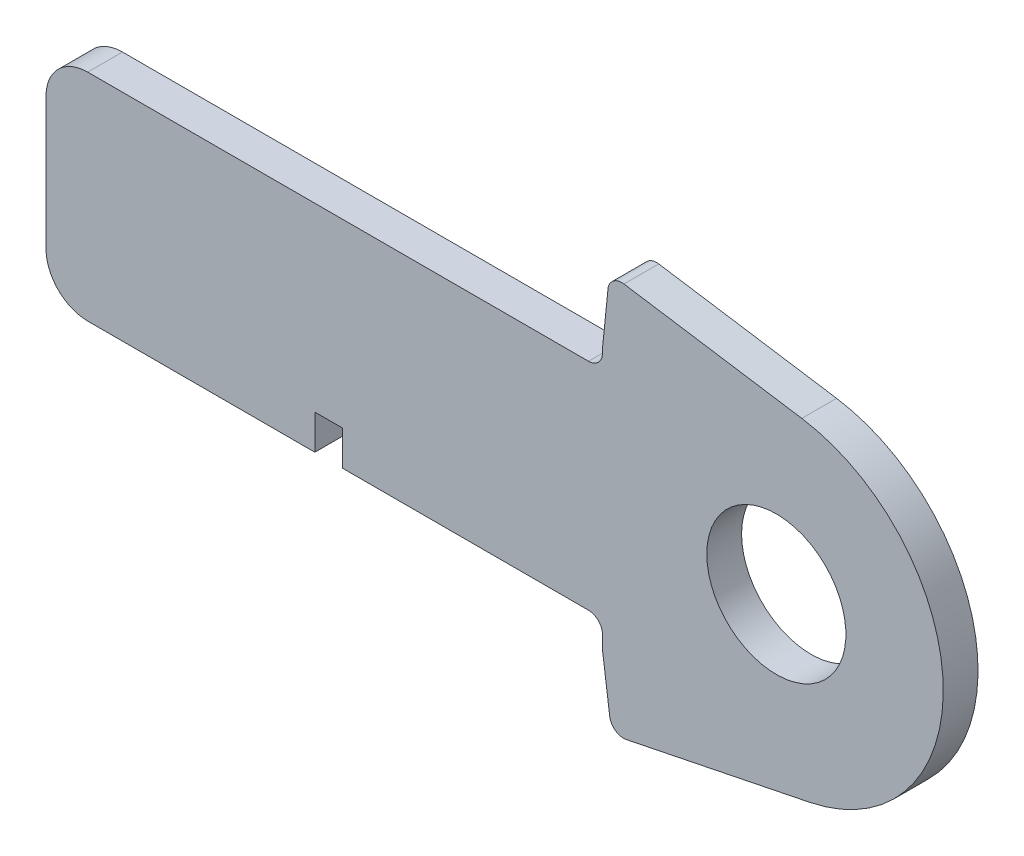
ISO-10303-21;
HEADER;
FILE_DESCRIPTION(('STEP AP214'),'2;1');
FILE_NAME('part.step','',(''),(''),'','','');
FILE_SCHEMA(('AUTOMOTIVE_DESIGN { 1 0 10303 214 1 1 1 1 }'));
ENDSEC;
DATA;
#1=APPLICATION_CONTEXT('core data for automotive mechanical design processes');
#2=APPLICATION_PROTOCOL_DEFINITION('international standard','automotive_design',2000,#1);
#3=PRODUCT_CONTEXT('',#1,'mechanical');
#4=PRODUCT('Part','Part','',(#3));
#5=PRODUCT_RELATED_PRODUCT_CATEGORY('part','',(#4));
#6=PRODUCT_DEFINITION_FORMATION('','',#4);
#7=PRODUCT_DEFINITION_CONTEXT('part definition',#1,'design');
#8=PRODUCT_DEFINITION('design','',#6,#7);
#9=PRODUCT_DEFINITION_SHAPE('','',#8);
#10=(LENGTH_UNIT() NAMED_UNIT(*) SI_UNIT(.MILLI.,.METRE.));
#11=(NAMED_UNIT(*) PLANE_ANGLE_UNIT() SI_UNIT($,.RADIAN.));
#12=(NAMED_UNIT(*) SI_UNIT($,.STERADIAN.) SOLID_ANGLE_UNIT());
#13=UNCERTAINTY_MEASURE_WITH_UNIT(LENGTH_MEASURE(1.E-05),#10,'distance_accuracy_value','');
#14=(GEOMETRIC_REPRESENTATION_CONTEXT(3) GLOBAL_UNCERTAINTY_ASSIGNED_CONTEXT((#13)) GLOBAL_UNIT_ASSIGNED_CONTEXT((#10,
#11,#12)) REPRESENTATION_CONTEXT('',''));
#15=CARTESIAN_POINT('',(0.,0.,0.));
#16=DIRECTION('',(0.,0.,1.));
#17=DIRECTION('',(1.,0.,0.));
#18=AXIS2_PLACEMENT_3D('',#15,#16,#17);
#19=CARTESIAN_POINT('',(213.422580288689,54.7287513036553,3.175));
#20=DIRECTION('',(0.,0.,-1.));
#21=DIRECTION('',(-1.,0.,0.));
#22=AXIS2_PLACEMENT_3D('',#19,#20,#21);
#23=PLANE('',#22);
#24=CARTESIAN_POINT('',(292.383806587551,26.255421434861,3.175));
#25=DIRECTION('',(0.,0.,-1.));
#26=DIRECTION('',(-1.,0.,0.));
#27=AXIS2_PLACEMENT_3D('',#24,#25,#26);
#28=CIRCLE('',#27,6.35);
#29=CARTESIAN_POINT('',(286.033806587551,26.255421434861,3.175));
#30=VERTEX_POINT('',#29);
#31=EDGE_CURVE('E292',#30,#30,#28,.T.);
#32=ORIENTED_EDGE('',*,*,#31,.T.);
#33=EDGE_LOOP('',(#32));
#34=FACE_BOUND('',#33,.T.);
#35=DIRECTION('',(-0.133331034869946,0.991071559041278,0.));
#36=VECTOR('',#35,1.);
#37=CARTESIAN_POINT('',(273.434595269181,36.7857570161253,3.175));
#38=LINE('',#37,#36);
#39=CARTESIAN_POINT('',(277.174368657139,8.98740499943636,3.175));
#40=VERTEX_POINT('',#39);
#41=CARTESIAN_POINT('',(276.508806587551,13.9346375667709,3.175));
#42=VERTEX_POINT('',#41);
#43=EDGE_CURVE('E243',#40,#42,#38,.T.);
#44=ORIENTED_EDGE('',*,*,#43,.F.);
#45=CARTESIAN_POINT('',(278.433029537121,9.15673541372118,3.175));
#46=DIRECTION('',(0.,0.,-1.));
#47=DIRECTION('',(-1.,0.,0.));
#48=AXIS2_PLACEMENT_3D('',#45,#46,#47);
#49=CIRCLE('',#48,1.27);
#50=CARTESIAN_POINT('',(278.686524593638,7.91229165994138,3.175));
#51=VERTEX_POINT('',#50);
#52=EDGE_CURVE('E318',#40,#51,#49,.F.);
#53=ORIENTED_EDGE('',*,*,#52,.T.);
#54=DIRECTION('',(0.979876971480177,0.199602406706023,0.));
#55=VECTOR('',#54,1.);
#56=CARTESIAN_POINT('',(9.55565157305778,-46.9100702664279,3.175));
#57=LINE('',#56,#55);
#58=CARTESIAN_POINT('',(295.425747265751,11.3220963895031,3.175));
#59=VERTEX_POINT('',#58);
#60=EDGE_CURVE('E241',#51,#59,#57,.T.);
#61=ORIENTED_EDGE('',*,*,#60,.T.);
#62=CARTESIAN_POINT('',(292.383806587551,26.255421434861,3.175));
#63=DIRECTION('',(0.,0.,1.));
#64=DIRECTION('',(1.,0.,0.));
#65=AXIS2_PLACEMENT_3D('',#62,#63,#64);
#66=CIRCLE('',#65,15.24);
#67=CARTESIAN_POINT('',(294.709258182036,41.3169577071576,3.175));
#68=VERTEX_POINT('',#67);
#69=EDGE_CURVE('E269',#59,#68,#66,.T.);
#70=ORIENTED_EDGE('',*,*,#69,.T.);
#71=DIRECTION('',(0.988289781646758,-0.152588687302186,0.));
#72=VECTOR('',#71,1.);
#73=CARTESIAN_POINT('',(13.0924795434369,84.7976608093711,3.175));
#74=LINE('',#73,#72);
#75=CARTESIAN_POINT('',(278.470624311763,43.824149293938,3.175));
#76=VERTEX_POINT('',#75);
#77=EDGE_CURVE('E267',#76,#68,#74,.T.);
#78=ORIENTED_EDGE('',*,*,#77,.F.);
#79=CARTESIAN_POINT('',(278.27683667889,42.5690212712466,3.175));
#80=DIRECTION('',(0.,0.,-1.));
#81=DIRECTION('',(-1.,0.,0.));
#82=AXIS2_PLACEMENT_3D('',#79,#80,#81);
#83=CIRCLE('',#82,1.27);
#84=CARTESIAN_POINT('',(277.013295568393,42.6969425833287,3.175));
#85=VERTEX_POINT('',#84);
#86=EDGE_CURVE('E316',#76,#85,#83,.F.);
#87=ORIENTED_EDGE('',*,*,#86,.T.);
#88=DIRECTION('',(0.10072544258434,0.994914260233609,0.));
#89=VECTOR('',#88,1.);
#90=CARTESIAN_POINT('',(269.924029023359,-27.3271962964349,3.175));
#91=LINE('',#90,#89);
#92=CARTESIAN_POINT('',(276.508806587551,37.7138591806421,3.175));
#93=VERTEX_POINT('',#92);
#94=EDGE_CURVE('E264',#93,#85,#91,.T.);
#95=ORIENTED_EDGE('',*,*,#94,.F.);
#96=DIRECTION('',(0.,1.,0.));
#97=VECTOR('',#96,1.);
#98=CARTESIAN_POINT('',(276.508806587551,0.,3.175));
#99=LINE('',#98,#97);
#100=CARTESIAN_POINT('',(276.508806587551,37.367921434861,3.175));
#101=VERTEX_POINT('',#100);
#102=EDGE_CURVE('E247',#101,#93,#99,.T.);
#103=ORIENTED_EDGE('',*,*,#102,.F.);
#104=CARTESIAN_POINT('',(275.238806587551,37.367921434861,3.175));
#105=DIRECTION('',(0.,0.,-1.));
#106=DIRECTION('',(-1.,0.,0.));
#107=AXIS2_PLACEMENT_3D('',#104,#105,#106);
#108=CIRCLE('',#107,1.27);
#109=CARTESIAN_POINT('',(275.238806587551,36.097921434861,3.175));
#110=VERTEX_POINT('',#109);
#111=EDGE_CURVE('E57',#101,#110,#108,.T.);
#112=ORIENTED_EDGE('',*,*,#111,.T.);
#113=DIRECTION('',(1.,0.,0.));
#114=VECTOR('',#113,1.);
#115=CARTESIAN_POINT('',(0.,36.097921434861,3.175));
#116=LINE('',#115,#114);
#117=CARTESIAN_POINT('',(229.518806587551,36.097921434861,3.175));
#118=VERTEX_POINT('',#117);
#119=EDGE_CURVE('E261',#118,#110,#116,.T.);
#120=ORIENTED_EDGE('',*,*,#119,.F.);
#121=CARTESIAN_POINT('',(229.518806587551,32.287921434861,3.175));
#122=DIRECTION('',(0.,0.,-1.));
#123=DIRECTION('',(-1.,0.,0.));
#124=AXIS2_PLACEMENT_3D('',#121,#122,#123);
#125=CIRCLE('',#124,3.81);
#126=CARTESIAN_POINT('',(225.708806587551,32.287921434861,3.175));
#127=VERTEX_POINT('',#126);
#128=EDGE_CURVE('E300',#118,#127,#125,.F.);
#129=ORIENTED_EDGE('',*,*,#128,.T.);
#130=DIRECTION('',(0.,-1.,0.));
#131=VECTOR('',#130,1.);
#132=CARTESIAN_POINT('',(225.708806587551,0.,3.175));
#133=LINE('',#132,#131);
#134=CARTESIAN_POINT('',(225.708806587551,20.222921434861,3.175));
#135=VERTEX_POINT('',#134);
#136=EDGE_CURVE('E258',#127,#135,#133,.T.);
#137=ORIENTED_EDGE('',*,*,#136,.T.);
#138=CARTESIAN_POINT('',(229.518806587551,20.222921434861,3.175));
#139=DIRECTION('',(0.,0.,-1.));
#140=DIRECTION('',(-1.,0.,0.));
#141=AXIS2_PLACEMENT_3D('',#138,#139,#140);
#142=CIRCLE('',#141,3.81);
#143=CARTESIAN_POINT('',(229.518806587551,16.412921434861,3.175));
#144=VERTEX_POINT('',#143);
#145=EDGE_CURVE('E302',#135,#144,#142,.F.);
#146=ORIENTED_EDGE('',*,*,#145,.T.);
#147=DIRECTION('',(1.,0.,0.));
#148=VECTOR('',#147,1.);
#149=CARTESIAN_POINT('',(0.,16.412921434861,3.175));
#150=LINE('',#149,#148);
#151=CARTESIAN_POINT('',(250.254440989192,16.412921434861,3.175));
#152=VERTEX_POINT('',#151);
#153=EDGE_CURVE('E250',#144,#152,#150,.T.);
#154=ORIENTED_EDGE('',*,*,#153,.T.);
#155=DIRECTION('',(0.,1.,0.));
#156=VECTOR('',#155,1.);
#157=CARTESIAN_POINT('',(250.254440989192,0.,3.175));
#158=LINE('',#157,#156);
#159=CARTESIAN_POINT('',(250.254440989192,19.587921434861,3.175));
#160=VERTEX_POINT('',#159);
#161=EDGE_CURVE('E255',#152,#160,#158,.T.);
#162=ORIENTED_EDGE('',*,*,#161,.T.);
#163=DIRECTION('',(1.,0.,0.));
#164=VECTOR('',#163,1.);
#165=CARTESIAN_POINT('',(0.,19.587921434861,3.175));
#166=LINE('',#165,#164);
#167=CARTESIAN_POINT('',(252.794440989192,19.587921434861,3.175));
#168=VERTEX_POINT('',#167);
#169=EDGE_CURVE('E252',#160,#168,#166,.T.);
#170=ORIENTED_EDGE('',*,*,#169,.T.);
#171=DIRECTION('',(0.,-1.,0.));
#172=VECTOR('',#171,1.);
#173=CARTESIAN_POINT('',(252.794440989192,0.,3.175));
#174=LINE('',#173,#172);
#175=CARTESIAN_POINT('',(252.794440989192,16.412921434861,3.175));
#176=VERTEX_POINT('',#175);
#177=EDGE_CURVE('E249',#168,#176,#174,.T.);
#178=ORIENTED_EDGE('',*,*,#177,.T.);
#179=CARTESIAN_POINT('',(275.238806587551,16.412921434861,3.175));
#180=VERTEX_POINT('',#179);
#181=EDGE_CURVE('E204',#176,#180,#150,.T.);
#182=ORIENTED_EDGE('',*,*,#181,.T.);
#183=CARTESIAN_POINT('',(275.238806587551,15.142921434861,3.175));
#184=DIRECTION('',(0.,0.,-1.));
#185=DIRECTION('',(-1.,0.,0.));
#186=AXIS2_PLACEMENT_3D('',#183,#184,#185);
#187=CIRCLE('',#186,1.27);
#188=CARTESIAN_POINT('',(276.508806587551,15.142921434861,3.175));
#189=VERTEX_POINT('',#188);
#190=EDGE_CURVE('E339',#180,#189,#187,.T.);
#191=ORIENTED_EDGE('',*,*,#190,.T.);
#192=EDGE_CURVE('E245',#42,#189,#99,.T.);
#193=ORIENTED_EDGE('',*,*,#192,.F.);
#194=EDGE_LOOP('',(#44,#53,#61,#70,#78,#87,#95,#103,#112,#120,#129,#137,#146,#154,#162,#170,
#178,#182,#191,#193));
#195=FACE_BOUND('',#194,.T.);
#196=ADVANCED_FACE('F49',(#34,#195),#23,.F.);
#197=CARTESIAN_POINT('',(213.422580288689,54.7287513036553,0.));
#198=DIRECTION('',(0.,0.,-1.));
#199=DIRECTION('',(-1.,0.,0.));
#200=AXIS2_PLACEMENT_3D('',#197,#198,#199);
#201=PLANE('',#200);
#202=CARTESIAN_POINT('',(292.383806587551,26.255421434861,0.));
#203=DIRECTION('',(0.,0.,-1.));
#204=DIRECTION('',(-1.,0.,0.));
#205=AXIS2_PLACEMENT_3D('',#202,#203,#204);
#206=CIRCLE('',#205,6.35);
#207=CARTESIAN_POINT('',(286.033806587551,26.255421434861,0.));
#208=VERTEX_POINT('',#207);
#209=EDGE_CURVE('E276',#208,#208,#206,.T.);
#210=ORIENTED_EDGE('',*,*,#209,.F.);
#211=EDGE_LOOP('',(#210));
#212=FACE_BOUND('',#211,.T.);
#213=DIRECTION('',(0.979876971480177,0.199602406706023,0.));
#214=VECTOR('',#213,1.);
#215=CARTESIAN_POINT('',(9.55565157305778,-46.9100702664279,0.));
#216=LINE('',#215,#214);
#217=CARTESIAN_POINT('',(278.686524593638,7.91229165994138,0.));
#218=VERTEX_POINT('',#217);
#219=CARTESIAN_POINT('',(295.425747265751,11.3220963895031,0.));
#220=VERTEX_POINT('',#219);
#221=EDGE_CURVE('E272',#218,#220,#216,.T.);
#222=ORIENTED_EDGE('',*,*,#221,.F.);
#223=CARTESIAN_POINT('',(278.433029537121,9.15673541372118,0.));
#224=DIRECTION('',(0.,0.,-1.));
#225=DIRECTION('',(-1.,0.,0.));
#226=AXIS2_PLACEMENT_3D('',#223,#224,#225);
#227=CIRCLE('',#226,1.27);
#228=CARTESIAN_POINT('',(277.174368657139,8.98740499943636,0.));
#229=VERTEX_POINT('',#228);
#230=EDGE_CURVE('E324',#218,#229,#227,.T.);
#231=ORIENTED_EDGE('',*,*,#230,.T.);
#232=DIRECTION('',(-0.133331034869946,0.991071559041278,0.));
#233=VECTOR('',#232,1.);
#234=CARTESIAN_POINT('',(273.434595269181,36.7857570161253,0.));
#235=LINE('',#234,#233);
#236=CARTESIAN_POINT('',(276.508806587551,13.9346375667709,0.));
#237=VERTEX_POINT('',#236);
#238=EDGE_CURVE('E213',#229,#237,#235,.T.);
#239=ORIENTED_EDGE('',*,*,#238,.T.);
#240=DIRECTION('',(0.,1.,0.));
#241=VECTOR('',#240,1.);
#242=CARTESIAN_POINT('',(276.508806587551,0.,0.));
#243=LINE('',#242,#241);
#244=CARTESIAN_POINT('',(276.508806587551,15.142921434861,0.));
#245=VERTEX_POINT('',#244);
#246=EDGE_CURVE('E210',#237,#245,#243,.T.);
#247=ORIENTED_EDGE('',*,*,#246,.T.);
#248=CARTESIAN_POINT('',(275.238806587551,15.142921434861,0.));
#249=DIRECTION('',(0.,0.,-1.));
#250=DIRECTION('',(-1.,0.,0.));
#251=AXIS2_PLACEMENT_3D('',#248,#249,#250);
#252=CIRCLE('',#251,1.27);
#253=CARTESIAN_POINT('',(275.238806587551,16.412921434861,0.));
#254=VERTEX_POINT('',#253);
#255=EDGE_CURVE('E64',#245,#254,#252,.F.);
#256=ORIENTED_EDGE('',*,*,#255,.T.);
#257=DIRECTION('',(1.,0.,0.));
#258=VECTOR('',#257,1.);
#259=CARTESIAN_POINT('',(0.,16.412921434861,0.));
#260=LINE('',#259,#258);
#261=CARTESIAN_POINT('',(252.794440989192,16.412921434861,0.));
#262=VERTEX_POINT('',#261);
#263=EDGE_CURVE('E197',#262,#254,#260,.T.);
#264=ORIENTED_EDGE('',*,*,#263,.F.);
#265=DIRECTION('',(0.,-1.,0.));
#266=VECTOR('',#265,1.);
#267=CARTESIAN_POINT('',(252.794440989192,0.,0.));
#268=LINE('',#267,#266);
#269=CARTESIAN_POINT('',(252.794440989192,19.587921434861,0.));
#270=VERTEX_POINT('',#269);
#271=EDGE_CURVE('E188',#270,#262,#268,.T.);
#272=ORIENTED_EDGE('',*,*,#271,.F.);
#273=DIRECTION('',(1.,0.,0.));
#274=VECTOR('',#273,1.);
#275=CARTESIAN_POINT('',(0.,19.587921434861,0.));
#276=LINE('',#275,#274);
#277=CARTESIAN_POINT('',(250.254440989192,19.587921434861,0.));
#278=VERTEX_POINT('',#277);
#279=EDGE_CURVE('E196',#278,#270,#276,.T.);
#280=ORIENTED_EDGE('',*,*,#279,.F.);
#281=DIRECTION('',(0.,1.,0.));
#282=VECTOR('',#281,1.);
#283=CARTESIAN_POINT('',(250.254440989192,0.,0.));
#284=LINE('',#283,#282);
#285=CARTESIAN_POINT('',(250.254440989192,16.412921434861,0.));
#286=VERTEX_POINT('',#285);
#287=EDGE_CURVE('E217',#286,#278,#284,.T.);
#288=ORIENTED_EDGE('',*,*,#287,.F.);
#289=CARTESIAN_POINT('',(229.518806587551,16.412921434861,0.));
#290=VERTEX_POINT('',#289);
#291=EDGE_CURVE('E212',#290,#286,#260,.T.);
#292=ORIENTED_EDGE('',*,*,#291,.F.);
#293=CARTESIAN_POINT('',(229.518806587551,20.222921434861,0.));
#294=DIRECTION('',(0.,0.,-1.));
#295=DIRECTION('',(-1.,0.,0.));
#296=AXIS2_PLACEMENT_3D('',#293,#294,#295);
#297=CIRCLE('',#296,3.81);
#298=CARTESIAN_POINT('',(225.708806587551,20.222921434861,0.));
#299=VERTEX_POINT('',#298);
#300=EDGE_CURVE('E308',#290,#299,#297,.T.);
#301=ORIENTED_EDGE('',*,*,#300,.T.);
#302=DIRECTION('',(0.,-1.,0.));
#303=VECTOR('',#302,1.);
#304=CARTESIAN_POINT('',(225.708806587551,0.,0.));
#305=LINE('',#304,#303);
#306=CARTESIAN_POINT('',(225.708806587551,32.287921434861,0.));
#307=VERTEX_POINT('',#306);
#308=EDGE_CURVE('E216',#307,#299,#305,.T.);
#309=ORIENTED_EDGE('',*,*,#308,.F.);
#310=CARTESIAN_POINT('',(229.518806587551,32.287921434861,0.));
#311=DIRECTION('',(0.,0.,-1.));
#312=DIRECTION('',(-1.,0.,0.));
#313=AXIS2_PLACEMENT_3D('',#310,#311,#312);
#314=CIRCLE('',#313,3.81);
#315=CARTESIAN_POINT('',(229.518806587551,36.097921434861,0.));
#316=VERTEX_POINT('',#315);
#317=EDGE_CURVE('E306',#307,#316,#314,.T.);
#318=ORIENTED_EDGE('',*,*,#317,.T.);
#319=DIRECTION('',(1.,0.,0.));
#320=VECTOR('',#319,1.);
#321=CARTESIAN_POINT('',(0.,36.097921434861,0.));
#322=LINE('',#321,#320);
#323=CARTESIAN_POINT('',(275.238806587551,36.097921434861,0.));
#324=VERTEX_POINT('',#323);
#325=EDGE_CURVE('E223',#316,#324,#322,.T.);
#326=ORIENTED_EDGE('',*,*,#325,.T.);
#327=CARTESIAN_POINT('',(275.238806587551,37.367921434861,0.));
#328=DIRECTION('',(0.,0.,-1.));
#329=DIRECTION('',(-1.,0.,0.));
#330=AXIS2_PLACEMENT_3D('',#327,#328,#329);
#331=CIRCLE('',#330,1.27);
#332=CARTESIAN_POINT('',(276.508806587551,37.367921434861,0.));
#333=VERTEX_POINT('',#332);
#334=EDGE_CURVE('E11',#324,#333,#331,.F.);
#335=ORIENTED_EDGE('',*,*,#334,.T.);
#336=CARTESIAN_POINT('',(276.508806587551,37.7138591806421,0.));
#337=VERTEX_POINT('',#336);
#338=EDGE_CURVE('E215',#333,#337,#243,.T.);
#339=ORIENTED_EDGE('',*,*,#338,.T.);
#340=DIRECTION('',(0.10072544258434,0.994914260233609,0.));
#341=VECTOR('',#340,1.);
#342=CARTESIAN_POINT('',(269.924029023359,-27.3271962964349,0.));
#343=LINE('',#342,#341);
#344=CARTESIAN_POINT('',(277.013295568393,42.6969425833287,0.));
#345=VERTEX_POINT('',#344);
#346=EDGE_CURVE('E233',#337,#345,#343,.T.);
#347=ORIENTED_EDGE('',*,*,#346,.T.);
#348=CARTESIAN_POINT('',(278.27683667889,42.5690212712466,0.));
#349=DIRECTION('',(0.,0.,-1.));
#350=DIRECTION('',(-1.,0.,0.));
#351=AXIS2_PLACEMENT_3D('',#348,#349,#350);
#352=CIRCLE('',#351,1.27);
#353=CARTESIAN_POINT('',(278.470624311763,43.824149293938,0.));
#354=VERTEX_POINT('',#353);
#355=EDGE_CURVE('E322',#345,#354,#352,.T.);
#356=ORIENTED_EDGE('',*,*,#355,.T.);
#357=DIRECTION('',(0.988289781646758,-0.152588687302186,0.));
#358=VECTOR('',#357,1.);
#359=CARTESIAN_POINT('',(13.0924795434369,84.7976608093711,0.));
#360=LINE('',#359,#358);
#361=CARTESIAN_POINT('',(294.709258182036,41.3169577071576,0.));
#362=VERTEX_POINT('',#361);
#363=EDGE_CURVE('E236',#354,#362,#360,.T.);
#364=ORIENTED_EDGE('',*,*,#363,.T.);
#365=CARTESIAN_POINT('',(292.383806587551,26.255421434861,0.));
#366=DIRECTION('',(0.,0.,1.));
#367=DIRECTION('',(1.,0.,0.));
#368=AXIS2_PLACEMENT_3D('',#365,#366,#367);
#369=CIRCLE('',#368,15.24);
#370=EDGE_CURVE('E238',#220,#362,#369,.T.);
#371=ORIENTED_EDGE('',*,*,#370,.F.);
#372=EDGE_LOOP('',(#222,#231,#239,#247,#256,#264,#272,#280,#288,#292,#301,#309,#318,#326,#335,
#339,#347,#356,#364,#371));
#373=FACE_BOUND('',#372,.T.);
#374=ADVANCED_FACE('F209',(#212,#373),#201,.T.);
#375=CARTESIAN_POINT('',(292.383806587551,26.255421434861,7.62));
#376=DIRECTION('',(0.,0.,-1.));
#377=DIRECTION('',(-1.,0.,0.));
#378=AXIS2_PLACEMENT_3D('',#375,#376,#377);
#379=CYLINDRICAL_SURFACE('',#378,6.35);
#380=CARTESIAN_POINT('',(286.033806587551,26.255421434861,0.));
#381=CARTESIAN_POINT('',(286.033806587551,26.255421434861,0.0330729166666668));
#382=CARTESIAN_POINT('',(286.033806587551,26.255421434861,0.0661458333333336));
#383=CARTESIAN_POINT('',(286.033806587551,26.255421434861,0.132291666666667));
#384=CARTESIAN_POINT('',(286.033806587551,26.255421434861,0.165364583333333));
#385=CARTESIAN_POINT('',(286.033806587551,26.255421434861,0.231510416666667));
#386=CARTESIAN_POINT('',(286.033806587551,26.255421434861,0.264583333333333));
#387=CARTESIAN_POINT('',(286.033806587551,26.255421434861,0.330729166666667));
#388=CARTESIAN_POINT('',(286.033806587551,26.255421434861,0.363802083333333));
#389=CARTESIAN_POINT('',(286.033806587551,26.255421434861,0.429947916666666));
#390=CARTESIAN_POINT('',(286.033806587551,26.255421434861,0.463020833333333));
#391=CARTESIAN_POINT('',(286.033806587551,26.255421434861,0.529166666666667));
#392=CARTESIAN_POINT('',(286.033806587551,26.255421434861,0.562239583333334));
#393=CARTESIAN_POINT('',(286.033806587551,26.255421434861,0.628385416666667));
#394=CARTESIAN_POINT('',(286.033806587551,26.255421434861,0.661458333333333));
#395=CARTESIAN_POINT('',(286.033806587551,26.255421434861,0.727604166666667));
#396=CARTESIAN_POINT('',(286.033806587551,26.255421434861,0.760677083333334));
#397=CARTESIAN_POINT('',(286.033806587551,26.255421434861,0.826822916666667));
#398=CARTESIAN_POINT('',(286.033806587551,26.255421434861,0.859895833333334));
#399=CARTESIAN_POINT('',(286.033806587551,26.255421434861,0.926041666666667));
#400=CARTESIAN_POINT('',(286.033806587551,26.255421434861,0.959114583333334));
#401=CARTESIAN_POINT('',(286.033806587551,26.255421434861,1.02526041666667));
#402=CARTESIAN_POINT('',(286.033806587551,26.255421434861,1.05833333333333));
#403=CARTESIAN_POINT('',(286.033806587551,26.255421434861,1.12447916666667));
#404=CARTESIAN_POINT('',(286.033806587551,26.255421434861,1.15755208333333));
#405=CARTESIAN_POINT('',(286.033806587551,26.255421434861,1.22369791666667));
#406=CARTESIAN_POINT('',(286.033806587551,26.255421434861,1.25677083333333));
#407=CARTESIAN_POINT('',(286.033806587551,26.255421434861,1.32291666666667));
#408=CARTESIAN_POINT('',(286.033806587551,26.255421434861,1.35598958333333));
#409=CARTESIAN_POINT('',(286.033806587551,26.255421434861,1.42213541666667));
#410=CARTESIAN_POINT('',(286.033806587551,26.255421434861,1.45520833333333));
#411=CARTESIAN_POINT('',(286.033806587551,26.255421434861,1.52135416666667));
#412=CARTESIAN_POINT('',(286.033806587551,26.255421434861,1.55442708333333));
#413=CARTESIAN_POINT('',(286.033806587551,26.255421434861,1.62057291666667));
#414=CARTESIAN_POINT('',(286.033806587551,26.255421434861,1.65364583333333));
#415=CARTESIAN_POINT('',(286.033806587551,26.255421434861,1.71979166666667));
#416=CARTESIAN_POINT('',(286.033806587551,26.255421434861,1.75286458333333));
#417=CARTESIAN_POINT('',(286.033806587551,26.255421434861,1.81901041666667));
#418=CARTESIAN_POINT('',(286.033806587551,26.255421434861,1.85208333333333));
#419=CARTESIAN_POINT('',(286.033806587551,26.255421434861,1.91822916666667));
#420=CARTESIAN_POINT('',(286.033806587551,26.255421434861,1.95130208333333));
#421=CARTESIAN_POINT('',(286.033806587551,26.255421434861,2.01744791666667));
#422=CARTESIAN_POINT('',(286.033806587551,26.255421434861,2.05052083333333));
#423=CARTESIAN_POINT('',(286.033806587551,26.255421434861,2.11666666666667));
#424=CARTESIAN_POINT('',(286.033806587551,26.255421434861,2.14973958333333));
#425=CARTESIAN_POINT('',(286.033806587551,26.255421434861,2.21588541666667));
#426=CARTESIAN_POINT('',(286.033806587551,26.255421434861,2.24895833333333));
#427=CARTESIAN_POINT('',(286.033806587551,26.255421434861,2.31510416666667));
#428=CARTESIAN_POINT('',(286.033806587551,26.255421434861,2.34817708333333));
#429=CARTESIAN_POINT('',(286.033806587551,26.255421434861,2.41432291666667));
#430=CARTESIAN_POINT('',(286.033806587551,26.255421434861,2.44739583333333));
#431=CARTESIAN_POINT('',(286.033806587551,26.255421434861,2.51354166666667));
#432=CARTESIAN_POINT('',(286.033806587551,26.255421434861,2.54661458333333));
#433=CARTESIAN_POINT('',(286.033806587551,26.255421434861,2.61276041666667));
#434=CARTESIAN_POINT('',(286.033806587551,26.255421434861,2.64583333333333));
#435=CARTESIAN_POINT('',(286.033806587551,26.255421434861,2.71197916666667));
#436=CARTESIAN_POINT('',(286.033806587551,26.255421434861,2.74505208333333));
#437=CARTESIAN_POINT('',(286.033806587551,26.255421434861,2.81119791666667));
#438=CARTESIAN_POINT('',(286.033806587551,26.255421434861,2.84427083333333));
#439=CARTESIAN_POINT('',(286.033806587551,26.255421434861,2.91041666666667));
#440=CARTESIAN_POINT('',(286.033806587551,26.255421434861,2.94348958333333));
#441=CARTESIAN_POINT('',(286.033806587551,26.255421434861,3.00963541666667));
#442=CARTESIAN_POINT('',(286.033806587551,26.255421434861,3.04270833333333));
#443=CARTESIAN_POINT('',(286.033806587551,26.255421434861,3.10885416666667));
#444=CARTESIAN_POINT('',(286.033806587551,26.255421434861,3.14192708333333));
#445=CARTESIAN_POINT('',(286.033806587551,26.255421434861,3.175));
#446=B_SPLINE_CURVE_WITH_KNOTS('',3,(#380,#381,#382,#383,#384,#385,#386,#387,#388,#389,#390,
#391,#392,#393,#394,#395,#396,#397,#398,#399,#400,#401,#402,#403,#404,#405,#406,#407,#408,#409,
#410,#411,#412,#413,#414,#415,#416,#417,#418,#419,#420,#421,#422,#423,#424,#425,#426,#427,#428,
#429,#430,#431,#432,#433,#434,#435,#436,#437,#438,#439,#440,#441,#442,#443,#444,#445),
.UNSPECIFIED.,.F.,.F.,(4,2,2,2,2,2,2,2,2,2,2,2,2,2,2,2,2,2,2,2,2,2,2,2,2,2,2,2,2,2,2,2,4),(0.,
0.0992187500000004,0.1984375,0.29765625,0.396875,0.49609375,0.5953125,0.69453125,0.79375,
0.892968750000001,0.9921875,1.09140625,1.190625,1.28984375,1.3890625,1.48828125,1.5875,
1.68671875,1.7859375,1.88515625,1.984375,2.08359375,2.1828125,2.28203125,2.38125,2.48046875,
2.5796875,2.67890625,2.778125,2.87734375,2.9765625,3.07578125,3.175),.UNSPECIFIED.);
#447=EDGE_CURVE('BSEAM398',#208,#30,#446,.T.);
#448=ORIENTED_EDGE('',*,*,#209,.T.);
#449=ORIENTED_EDGE('',*,*,#31,.F.);
#450=ORIENTED_EDGE('',*,*,#447,.T.);
#451=ORIENTED_EDGE('',*,*,#447,.F.);
#452=EDGE_LOOP('',(#448,#450,#449,#451));
#453=FACE_BOUND('',#452,.T.);
#454=ADVANCED_FACE('F398',(#453),#379,.F.);
#455=CARTESIAN_POINT('',(9.55565157305778,-46.9100702664279,0.));
#456=DIRECTION('',(0.199602406706023,-0.979876971480177,0.));
#457=DIRECTION('',(0.979876971480177,0.199602406706023,0.));
#458=AXIS2_PLACEMENT_3D('',#455,#456,#457);
#459=PLANE('',#458);
#460=ORIENTED_EDGE('',*,*,#60,.F.);
#461=DIRECTION('',(0.,0.,1.));
#462=VECTOR('',#461,1.);
#463=CARTESIAN_POINT('',(278.686524593638,7.91229165994136,0.));
#464=LINE('',#463,#462);
#465=EDGE_CURVE('E320',#51,#218,#464,.F.);
#466=ORIENTED_EDGE('',*,*,#465,.T.);
#467=ORIENTED_EDGE('',*,*,#221,.T.);
#468=DIRECTION('',(0.,0.,1.));
#469=VECTOR('',#468,1.);
#470=CARTESIAN_POINT('',(295.425747265751,11.3220963895031,0.));
#471=LINE('',#470,#469);
#472=EDGE_CURVE('E273',#220,#59,#471,.T.);
#473=ORIENTED_EDGE('',*,*,#472,.T.);
#474=EDGE_LOOP('',(#460,#466,#467,#473));
#475=FACE_BOUND('',#474,.T.);
#476=ADVANCED_FACE('F364',(#475),#459,.T.);
#477=CARTESIAN_POINT('',(292.383806587551,26.255421434861,0.));
#478=DIRECTION('',(0.,0.,1.));
#479=DIRECTION('',(1.,0.,0.));
#480=AXIS2_PLACEMENT_3D('',#477,#478,#479);
#481=CYLINDRICAL_SURFACE('',#480,15.24);
#482=ORIENTED_EDGE('',*,*,#69,.F.);
#483=ORIENTED_EDGE('',*,*,#472,.F.);
#484=ORIENTED_EDGE('',*,*,#370,.T.);
#485=DIRECTION('',(0.,0.,1.));
#486=VECTOR('',#485,1.);
#487=CARTESIAN_POINT('',(294.709258182036,41.3169577071576,0.));
#488=LINE('',#487,#486);
#489=EDGE_CURVE('E277',#362,#68,#488,.T.);
#490=ORIENTED_EDGE('',*,*,#489,.T.);
#491=EDGE_LOOP('',(#482,#483,#484,#490));
#492=FACE_BOUND('',#491,.T.);
#493=ADVANCED_FACE('F370',(#492),#481,.T.);
#494=CARTESIAN_POINT('',(13.0924795434369,84.7976608093711,0.));
#495=DIRECTION('',(-0.152588687302185,-0.988289781646758,0.));
#496=DIRECTION('',(0.988289781646758,-0.152588687302186,0.));
#497=AXIS2_PLACEMENT_3D('',#494,#495,#496);
#498=PLANE('',#497);
#499=ORIENTED_EDGE('',*,*,#363,.F.);
#500=DIRECTION('',(0.,0.,1.));
#501=VECTOR('',#500,1.);
#502=CARTESIAN_POINT('',(278.470624311763,43.824149293938,0.));
#503=LINE('',#502,#501);
#504=EDGE_CURVE('E326',#354,#76,#503,.T.);
#505=ORIENTED_EDGE('',*,*,#504,.T.);
#506=ORIENTED_EDGE('',*,*,#77,.T.);
#507=ORIENTED_EDGE('',*,*,#489,.F.);
#508=EDGE_LOOP('',(#499,#505,#506,#507));
#509=FACE_BOUND('',#508,.T.);
#510=ADVANCED_FACE('F376',(#509),#498,.F.);
#511=CARTESIAN_POINT('',(269.924029023359,-27.3271962964349,0.));
#512=DIRECTION('',(0.994914260233609,-0.10072544258434,0.));
#513=DIRECTION('',(0.10072544258434,0.994914260233609,0.));
#514=AXIS2_PLACEMENT_3D('',#511,#512,#513);
#515=PLANE('',#514);
#516=ORIENTED_EDGE('',*,*,#94,.T.);
#517=DIRECTION('',(0.,0.,1.));
#518=VECTOR('',#517,1.);
#519=CARTESIAN_POINT('',(277.013295568393,42.6969425833287,0.));
#520=LINE('',#519,#518);
#521=EDGE_CURVE('E329',#85,#345,#520,.F.);
#522=ORIENTED_EDGE('',*,*,#521,.T.);
#523=ORIENTED_EDGE('',*,*,#346,.F.);
#524=DIRECTION('',(0.,0.,1.));
#525=VECTOR('',#524,1.);
#526=CARTESIAN_POINT('',(276.508806587551,37.7138591806421,0.));
#527=LINE('',#526,#525);
#528=EDGE_CURVE('E280',#337,#93,#527,.T.);
#529=ORIENTED_EDGE('',*,*,#528,.T.);
#530=EDGE_LOOP('',(#516,#522,#523,#529));
#531=FACE_BOUND('',#530,.T.);
#532=ADVANCED_FACE('F382',(#531),#515,.F.);
#533=CARTESIAN_POINT('',(276.508806587551,0.,0.));
#534=DIRECTION('',(1.,0.,0.));
#535=DIRECTION('',(0.,0.,-1.));
#536=AXIS2_PLACEMENT_3D('',#533,#534,#535);
#537=PLANE('',#536);
#538=ORIENTED_EDGE('',*,*,#338,.F.);
#539=DIRECTION('',(0.,0.,1.));
#540=VECTOR('',#539,1.);
#541=CARTESIAN_POINT('',(276.508806587551,37.367921434861,3.175));
#542=LINE('',#541,#540);
#543=EDGE_CURVE('E334',#333,#101,#542,.T.);
#544=ORIENTED_EDGE('',*,*,#543,.T.);
#545=ORIENTED_EDGE('',*,*,#102,.T.);
#546=ORIENTED_EDGE('',*,*,#528,.F.);
#547=EDGE_LOOP('',(#538,#544,#545,#546));
#548=FACE_BOUND('',#547,.T.);
#549=ADVANCED_FACE('F357',(#548),#537,.F.);
#550=CARTESIAN_POINT('',(0.,36.097921434861,0.));
#551=DIRECTION('',(0.,-1.,0.));
#552=DIRECTION('',(0.,0.,-1.));
#553=AXIS2_PLACEMENT_3D('',#550,#551,#552);
#554=PLANE('',#553);
#555=ORIENTED_EDGE('',*,*,#119,.T.);
#556=DIRECTION('',(0.,0.,1.));
#557=VECTOR('',#556,1.);
#558=CARTESIAN_POINT('',(275.238806587551,36.097921434861,0.));
#559=LINE('',#558,#557);
#560=EDGE_CURVE('E337',#110,#324,#559,.F.);
#561=ORIENTED_EDGE('',*,*,#560,.T.);
#562=ORIENTED_EDGE('',*,*,#325,.F.);
#563=DIRECTION('',(0.,0.,1.));
#564=VECTOR('',#563,1.);
#565=CARTESIAN_POINT('',(229.518806587551,36.097921434861,3.175));
#566=LINE('',#565,#564);
#567=EDGE_CURVE('E310',#316,#118,#566,.T.);
#568=ORIENTED_EDGE('',*,*,#567,.T.);
#569=EDGE_LOOP('',(#555,#561,#562,#568));
#570=FACE_BOUND('',#569,.T.);
#571=ADVANCED_FACE('F350',(#570),#554,.F.);
#572=CARTESIAN_POINT('',(225.708806587551,0.,0.));
#573=DIRECTION('',(-1.,0.,0.));
#574=DIRECTION('',(0.,0.,1.));
#575=AXIS2_PLACEMENT_3D('',#572,#573,#574);
#576=PLANE('',#575);
#577=ORIENTED_EDGE('',*,*,#308,.T.);
#578=DIRECTION('',(0.,0.,1.));
#579=VECTOR('',#578,1.);
#580=CARTESIAN_POINT('',(225.708806587551,20.222921434861,0.));
#581=LINE('',#580,#579);
#582=EDGE_CURVE('E297',#299,#135,#581,.T.);
#583=ORIENTED_EDGE('',*,*,#582,.T.);
#584=ORIENTED_EDGE('',*,*,#136,.F.);
#585=DIRECTION('',(0.,0.,1.));
#586=VECTOR('',#585,1.);
#587=CARTESIAN_POINT('',(225.708806587551,32.287921434861,0.));
#588=LINE('',#587,#586);
#589=EDGE_CURVE('E295',#127,#307,#588,.F.);
#590=ORIENTED_EDGE('',*,*,#589,.T.);
#591=EDGE_LOOP('',(#577,#583,#584,#590));
#592=FACE_BOUND('',#591,.T.);
#593=ADVANCED_FACE('F435',(#592),#576,.T.);
#594=CARTESIAN_POINT('',(0.,16.412921434861,0.));
#595=DIRECTION('',(0.,-1.,0.));
#596=DIRECTION('',(1.,0.,0.));
#597=AXIS2_PLACEMENT_3D('',#594,#595,#596);
#598=PLANE('',#597);
#599=ORIENTED_EDGE('',*,*,#153,.F.);
#600=DIRECTION('',(0.,0.,1.));
#601=VECTOR('',#600,1.);
#602=CARTESIAN_POINT('',(229.518806587551,16.412921434861,0.));
#603=LINE('',#602,#601);
#604=EDGE_CURVE('E304',#144,#290,#603,.F.);
#605=ORIENTED_EDGE('',*,*,#604,.T.);
#606=ORIENTED_EDGE('',*,*,#291,.T.);
#607=DIRECTION('',(0.,0.,1.));
#608=VECTOR('',#607,1.);
#609=CARTESIAN_POINT('',(250.254440989192,16.412921434861,0.));
#610=LINE('',#609,#608);
#611=EDGE_CURVE('E283',#286,#152,#610,.T.);
#612=ORIENTED_EDGE('',*,*,#611,.T.);
#613=EDGE_LOOP('',(#599,#605,#606,#612));
#614=FACE_BOUND('',#613,.T.);
#615=ADVANCED_FACE('F439',(#614),#598,.T.);
#616=CARTESIAN_POINT('',(250.254440989192,0.,0.));
#617=DIRECTION('',(1.,0.,0.));
#618=DIRECTION('',(0.,0.,-1.));
#619=AXIS2_PLACEMENT_3D('',#616,#617,#618);
#620=PLANE('',#619);
#621=ORIENTED_EDGE('',*,*,#161,.F.);
#622=ORIENTED_EDGE('',*,*,#611,.F.);
#623=ORIENTED_EDGE('',*,*,#287,.T.);
#624=DIRECTION('',(0.,0.,1.));
#625=VECTOR('',#624,1.);
#626=CARTESIAN_POINT('',(250.254440989192,19.587921434861,0.));
#627=LINE('',#626,#625);
#628=EDGE_CURVE('E285',#278,#160,#627,.T.);
#629=ORIENTED_EDGE('',*,*,#628,.T.);
#630=EDGE_LOOP('',(#621,#622,#623,#629));
#631=FACE_BOUND('',#630,.T.);
#632=ADVANCED_FACE('F440',(#631),#620,.T.);
#633=CARTESIAN_POINT('',(0.,19.587921434861,0.));
#634=DIRECTION('',(0.,-1.,0.));
#635=DIRECTION('',(0.,0.,-1.));
#636=AXIS2_PLACEMENT_3D('',#633,#634,#635);
#637=PLANE('',#636);
#638=ORIENTED_EDGE('',*,*,#169,.F.);
#639=ORIENTED_EDGE('',*,*,#628,.F.);
#640=ORIENTED_EDGE('',*,*,#279,.T.);
#641=DIRECTION('',(0.,0.,1.));
#642=VECTOR('',#641,1.);
#643=CARTESIAN_POINT('',(252.794440989192,19.587921434861,0.));
#644=LINE('',#643,#642);
#645=EDGE_CURVE('E194',#270,#168,#644,.T.);
#646=ORIENTED_EDGE('',*,*,#645,.T.);
#647=EDGE_LOOP('',(#638,#639,#640,#646));
#648=FACE_BOUND('',#647,.T.);
#649=ADVANCED_FACE('F428',(#648),#637,.T.);
#650=CARTESIAN_POINT('',(252.794440989192,0.,0.));
#651=DIRECTION('',(-1.,0.,0.));
#652=DIRECTION('',(0.,0.,1.));
#653=AXIS2_PLACEMENT_3D('',#650,#651,#652);
#654=PLANE('',#653);
#655=ORIENTED_EDGE('',*,*,#177,.F.);
#656=ORIENTED_EDGE('',*,*,#645,.F.);
#657=ORIENTED_EDGE('',*,*,#271,.T.);
#658=DIRECTION('',(0.,0.,1.));
#659=VECTOR('',#658,1.);
#660=CARTESIAN_POINT('',(252.794440989192,16.412921434861,0.));
#661=LINE('',#660,#659);
#662=EDGE_CURVE('E192',#262,#176,#661,.T.);
#663=ORIENTED_EDGE('',*,*,#662,.T.);
#664=EDGE_LOOP('',(#655,#656,#657,#663));
#665=FACE_BOUND('',#664,.T.);
#666=ADVANCED_FACE('F191',(#665),#654,.T.);
#667=ORIENTED_EDGE('',*,*,#263,.T.);
#668=DIRECTION('',(0.,0.,1.));
#669=VECTOR('',#668,1.);
#670=CARTESIAN_POINT('',(275.238806587551,16.412921434861,0.));
#671=LINE('',#670,#669);
#672=EDGE_CURVE('E331',#254,#180,#671,.T.);
#673=ORIENTED_EDGE('',*,*,#672,.T.);
#674=ORIENTED_EDGE('',*,*,#181,.F.);
#675=ORIENTED_EDGE('',*,*,#662,.F.);
#676=EDGE_LOOP('',(#667,#673,#674,#675));
#677=FACE_BOUND('',#676,.T.);
#678=ADVANCED_FACE('F200',(#677),#598,.T.);
#679=ORIENTED_EDGE('',*,*,#192,.T.);
#680=DIRECTION('',(0.,0.,1.));
#681=VECTOR('',#680,1.);
#682=CARTESIAN_POINT('',(276.508806587551,15.142921434861,0.));
#683=LINE('',#682,#681);
#684=EDGE_CURVE('E72',#189,#245,#683,.F.);
#685=ORIENTED_EDGE('',*,*,#684,.T.);
#686=ORIENTED_EDGE('',*,*,#246,.F.);
#687=DIRECTION('',(0.,0.,1.));
#688=VECTOR('',#687,1.);
#689=CARTESIAN_POINT('',(276.508806587551,13.9346375667709,0.));
#690=LINE('',#689,#688);
#691=EDGE_CURVE('E206',#237,#42,#690,.T.);
#692=ORIENTED_EDGE('',*,*,#691,.T.);
#693=EDGE_LOOP('',(#679,#685,#686,#692));
#694=FACE_BOUND('',#693,.T.);
#695=ADVANCED_FACE('F390',(#694),#537,.F.);
#696=CARTESIAN_POINT('',(273.434595269181,36.7857570161253,0.));
#697=DIRECTION('',(0.991071559041278,0.133331034869946,0.));
#698=DIRECTION('',(-0.133331034869946,0.991071559041278,0.));
#699=AXIS2_PLACEMENT_3D('',#696,#697,#698);
#700=PLANE('',#699);
#701=ORIENTED_EDGE('',*,*,#238,.F.);
#702=DIRECTION('',(0.,0.,1.));
#703=VECTOR('',#702,1.);
#704=CARTESIAN_POINT('',(277.174368657139,8.98740499943635,3.175));
#705=LINE('',#704,#703);
#706=EDGE_CURVE('E313',#229,#40,#705,.T.);
#707=ORIENTED_EDGE('',*,*,#706,.T.);
#708=ORIENTED_EDGE('',*,*,#43,.T.);
#709=ORIENTED_EDGE('',*,*,#691,.F.);
#710=EDGE_LOOP('',(#701,#707,#708,#709));
#711=FACE_BOUND('',#710,.T.);
#712=ADVANCED_FACE('F408',(#711),#700,.F.);
#713=CARTESIAN_POINT('',(229.518806587551,20.222921434861,0.));
#714=DIRECTION('',(0.,0.,1.));
#715=DIRECTION('',(1.,0.,0.));
#716=AXIS2_PLACEMENT_3D('',#713,#714,#715);
#717=CYLINDRICAL_SURFACE('',#716,3.81);
#718=ORIENTED_EDGE('',*,*,#300,.F.);
#719=ORIENTED_EDGE('',*,*,#604,.F.);
#720=ORIENTED_EDGE('',*,*,#145,.F.);
#721=ORIENTED_EDGE('',*,*,#582,.F.);
#722=EDGE_LOOP('',(#718,#719,#720,#721));
#723=FACE_BOUND('',#722,.T.);
#724=ADVANCED_FACE('F404',(#723),#717,.T.);
#725=CARTESIAN_POINT('',(229.518806587551,32.287921434861,0.));
#726=DIRECTION('',(0.,0.,-1.));
#727=DIRECTION('',(-1.,0.,0.));
#728=AXIS2_PLACEMENT_3D('',#725,#726,#727);
#729=CYLINDRICAL_SURFACE('',#728,3.81);
#730=ORIENTED_EDGE('',*,*,#317,.F.);
#731=ORIENTED_EDGE('',*,*,#589,.F.);
#732=ORIENTED_EDGE('',*,*,#128,.F.);
#733=ORIENTED_EDGE('',*,*,#567,.F.);
#734=EDGE_LOOP('',(#730,#731,#732,#733));
#735=FACE_BOUND('',#734,.T.);
#736=ADVANCED_FACE('F407',(#735),#729,.T.);
#737=CARTESIAN_POINT('',(278.433029537121,9.15673541372118,0.));
#738=DIRECTION('',(0.,0.,-1.));
#739=DIRECTION('',(-1.,0.,0.));
#740=AXIS2_PLACEMENT_3D('',#737,#738,#739);
#741=CYLINDRICAL_SURFACE('',#740,1.27);
#742=ORIENTED_EDGE('',*,*,#230,.F.);
#743=ORIENTED_EDGE('',*,*,#465,.F.);
#744=ORIENTED_EDGE('',*,*,#52,.F.);
#745=ORIENTED_EDGE('',*,*,#706,.F.);
#746=EDGE_LOOP('',(#742,#743,#744,#745));
#747=FACE_BOUND('',#746,.T.);
#748=ADVANCED_FACE('F412',(#747),#741,.T.);
#749=CARTESIAN_POINT('',(278.27683667889,42.5690212712466,0.));
#750=DIRECTION('',(0.,0.,1.));
#751=DIRECTION('',(1.,0.,0.));
#752=AXIS2_PLACEMENT_3D('',#749,#750,#751);
#753=CYLINDRICAL_SURFACE('',#752,1.27);
#754=ORIENTED_EDGE('',*,*,#355,.F.);
#755=ORIENTED_EDGE('',*,*,#521,.F.);
#756=ORIENTED_EDGE('',*,*,#86,.F.);
#757=ORIENTED_EDGE('',*,*,#504,.F.);
#758=EDGE_LOOP('',(#754,#755,#756,#757));
#759=FACE_BOUND('',#758,.T.);
#760=ADVANCED_FACE('F379',(#759),#753,.T.);
#761=CARTESIAN_POINT('',(275.238806587551,15.142921434861,0.));
#762=DIRECTION('',(0.,0.,1.));
#763=DIRECTION('',(1.,0.,0.));
#764=AXIS2_PLACEMENT_3D('',#761,#762,#763);
#765=CYLINDRICAL_SURFACE('',#764,1.27);
#766=ORIENTED_EDGE('',*,*,#255,.F.);
#767=ORIENTED_EDGE('',*,*,#684,.F.);
#768=ORIENTED_EDGE('',*,*,#190,.F.);
#769=ORIENTED_EDGE('',*,*,#672,.F.);
#770=EDGE_LOOP('',(#766,#767,#768,#769));
#771=FACE_BOUND('',#770,.T.);
#772=ADVANCED_FACE('F418',(#771),#765,.F.);
#773=CARTESIAN_POINT('',(275.238806587551,37.367921434861,0.));
#774=DIRECTION('',(0.,0.,-1.));
#775=DIRECTION('',(-1.,0.,0.));
#776=AXIS2_PLACEMENT_3D('',#773,#774,#775);
#777=CYLINDRICAL_SURFACE('',#776,1.27);
#778=ORIENTED_EDGE('',*,*,#334,.F.);
#779=ORIENTED_EDGE('',*,*,#560,.F.);
#780=ORIENTED_EDGE('',*,*,#111,.F.);
#781=ORIENTED_EDGE('',*,*,#543,.F.);
#782=EDGE_LOOP('',(#778,#779,#780,#781));
#783=FACE_BOUND('',#782,.T.);
#784=ADVANCED_FACE('F51',(#783),#777,.F.);
#785=CLOSED_SHELL('',(#196,#374,#454,#476,#493,#510,#532,#549,#571,#593,#615,#632,#649,#666,
#678,#695,#712,#724,#736,#748,#760,#772,#784));
#786=MANIFOLD_SOLID_BREP('B2',#785);
#787=ADVANCED_BREP_SHAPE_REPRESENTATION('',(#18,#786),#14);
#788=SHAPE_DEFINITION_REPRESENTATION(#9,#787);
ENDSEC;
END-ISO-10303-21;
